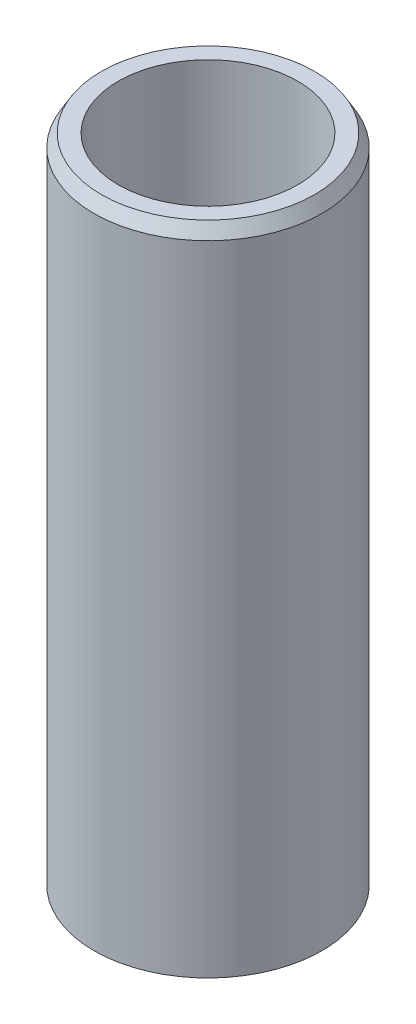
ISO-10303-21;
HEADER;
FILE_DESCRIPTION(('STEP AP214'),'2;1');
FILE_NAME('part.step','',(''),(''),'','','');
FILE_SCHEMA(('AUTOMOTIVE_DESIGN { 1 0 10303 214 1 1 1 1 }'));
ENDSEC;
DATA;
#1=APPLICATION_CONTEXT('core data for automotive mechanical design processes');
#2=APPLICATION_PROTOCOL_DEFINITION('international standard','automotive_design',2000,#1);
#3=PRODUCT_CONTEXT('',#1,'mechanical');
#4=PRODUCT('Part','Part','',(#3));
#5=PRODUCT_RELATED_PRODUCT_CATEGORY('part','',(#4));
#6=PRODUCT_DEFINITION_FORMATION('','',#4);
#7=PRODUCT_DEFINITION_CONTEXT('part definition',#1,'design');
#8=PRODUCT_DEFINITION('design','',#6,#7);
#9=PRODUCT_DEFINITION_SHAPE('','',#8);
#10=(LENGTH_UNIT() NAMED_UNIT(*) SI_UNIT(.MILLI.,.METRE.));
#11=(NAMED_UNIT(*) PLANE_ANGLE_UNIT() SI_UNIT($,.RADIAN.));
#12=(NAMED_UNIT(*) SI_UNIT($,.STERADIAN.) SOLID_ANGLE_UNIT());
#13=UNCERTAINTY_MEASURE_WITH_UNIT(LENGTH_MEASURE(1.E-05),#10,'distance_accuracy_value','');
#14=(GEOMETRIC_REPRESENTATION_CONTEXT(3) GLOBAL_UNCERTAINTY_ASSIGNED_CONTEXT((#13)) GLOBAL_UNIT_ASSIGNED_CONTEXT((#10,
#11,#12)) REPRESENTATION_CONTEXT('',''));
#15=CARTESIAN_POINT('',(0.,0.,0.));
#16=DIRECTION('',(0.,0.,1.));
#17=DIRECTION('',(1.,0.,0.));
#18=AXIS2_PLACEMENT_3D('',#15,#16,#17);
#19=CARTESIAN_POINT('',(0.,288.745215291546,0.));
#20=DIRECTION('',(0.,-1.,0.));
#21=DIRECTION('',(0.,0.,-1.));
#22=AXIS2_PLACEMENT_3D('',#19,#20,#21);
#23=CYLINDRICAL_SURFACE('',#22,50.);
#24=CARTESIAN_POINT('',(0.,283.167460944101,0.));
#25=DIRECTION('',(0.,1.,0.));
#26=DIRECTION('',(0.,0.,1.));
#27=AXIS2_PLACEMENT_3D('',#24,#25,#26);
#28=CIRCLE('',#27,50.);
#29=CARTESIAN_POINT('',(0.,283.167460944101,50.));
#30=VERTEX_POINT('',#29);
#31=EDGE_CURVE('E50',#30,#30,#28,.F.);
#32=ORIENTED_EDGE('',*,*,#31,.T.);
#33=EDGE_LOOP('',(#32));
#34=FACE_BOUND('',#33,.T.);
#35=CARTESIAN_POINT('',(0.,3.22031797397099,0.));
#36=DIRECTION('',(0.,1.,0.));
#37=DIRECTION('',(0.,0.,1.));
#38=AXIS2_PLACEMENT_3D('',#35,#36,#37);
#39=CIRCLE('',#38,50.);
#40=CARTESIAN_POINT('',(0.,3.22031797397099,50.));
#41=VERTEX_POINT('',#40);
#42=EDGE_CURVE('E51',#41,#41,#39,.T.);
#43=ORIENTED_EDGE('',*,*,#42,.T.);
#44=EDGE_LOOP('',(#43));
#45=FACE_BOUND('',#44,.T.);
#46=ADVANCED_FACE('F39',(#34,#45),#23,.T.);
#47=CARTESIAN_POINT('',(0.,288.745215291546,0.));
#48=DIRECTION('',(0.,1.,0.));
#49=DIRECTION('',(0.,0.,1.));
#50=AXIS2_PLACEMENT_3D('',#47,#48,#49);
#51=PLANE('',#50);
#52=CARTESIAN_POINT('',(0.,288.745215291546,0.));
#53=DIRECTION('',(0.,1.,0.));
#54=DIRECTION('',(0.,0.,1.));
#55=AXIS2_PLACEMENT_3D('',#52,#53,#54);
#56=CIRCLE('',#55,46.7796820260291);
#57=CARTESIAN_POINT('',(0.,288.745215291546,46.7796820260291));
#58=VERTEX_POINT('',#57);
#59=EDGE_CURVE('E54',#58,#58,#56,.T.);
#60=ORIENTED_EDGE('',*,*,#59,.T.);
#61=EDGE_LOOP('',(#60));
#62=FACE_BOUND('',#61,.T.);
#63=CARTESIAN_POINT('',(0.,288.745215291546,0.));
#64=DIRECTION('',(0.,1.,0.));
#65=DIRECTION('',(0.,0.,1.));
#66=AXIS2_PLACEMENT_3D('',#63,#64,#65);
#67=CIRCLE('',#66,39.3678445322698);
#68=CARTESIAN_POINT('',(0.,288.745215291546,39.3678445322698));
#69=VERTEX_POINT('',#68);
#70=EDGE_CURVE('E58',#69,#69,#67,.T.);
#71=ORIENTED_EDGE('',*,*,#70,.F.);
#72=EDGE_LOOP('',(#71));
#73=FACE_BOUND('',#72,.T.);
#74=ADVANCED_FACE('F69',(#62,#73),#51,.T.);
#75=CARTESIAN_POINT('',(0.,0.,0.));
#76=DIRECTION('',(0.,1.,0.));
#77=DIRECTION('',(0.,0.,1.));
#78=AXIS2_PLACEMENT_3D('',#75,#76,#77);
#79=PLANE('',#78);
#80=CARTESIAN_POINT('',(0.,0.,0.));
#81=DIRECTION('',(0.,1.,0.));
#82=DIRECTION('',(0.,0.,1.));
#83=AXIS2_PLACEMENT_3D('',#80,#81,#82);
#84=CIRCLE('',#83,44.4222456525549);
#85=CARTESIAN_POINT('',(0.,0.,44.4222456525549));
#86=VERTEX_POINT('',#85);
#87=EDGE_CURVE('E10',#86,#86,#84,.F.);
#88=ORIENTED_EDGE('',*,*,#87,.T.);
#89=EDGE_LOOP('',(#88));
#90=FACE_BOUND('',#89,.T.);
#91=CARTESIAN_POINT('',(0.,0.,0.));
#92=DIRECTION('',(0.,1.,0.));
#93=DIRECTION('',(0.,0.,1.));
#94=AXIS2_PLACEMENT_3D('',#91,#92,#93);
#95=CIRCLE('',#94,39.3678445322698);
#96=CARTESIAN_POINT('',(0.,0.,39.3678445322698));
#97=VERTEX_POINT('',#96);
#98=EDGE_CURVE('E63',#97,#97,#95,.T.);
#99=ORIENTED_EDGE('',*,*,#98,.T.);
#100=EDGE_LOOP('',(#99));
#101=FACE_BOUND('',#100,.T.);
#102=ADVANCED_FACE('F75',(#90,#101),#79,.F.);
#103=CARTESIAN_POINT('',(0.,288.745215291546,0.));
#104=DIRECTION('',(0.,-1.,0.));
#105=DIRECTION('',(0.,0.,-1.));
#106=AXIS2_PLACEMENT_3D('',#103,#104,#105);
#107=CYLINDRICAL_SURFACE('',#106,39.3678445322698);
#108=ORIENTED_EDGE('',*,*,#70,.T.);
#109=EDGE_LOOP('',(#108));
#110=FACE_BOUND('',#109,.T.);
#111=ORIENTED_EDGE('',*,*,#98,.F.);
#112=EDGE_LOOP('',(#111));
#113=FACE_BOUND('',#112,.T.);
#114=ADVANCED_FACE('F70',(#110,#113),#107,.F.);
#115=CARTESIAN_POINT('',(0.,288.745215291546,0.));
#116=DIRECTION('',(0.,-1.,0.));
#117=DIRECTION('',(0.,0.,-1.));
#118=AXIS2_PLACEMENT_3D('',#115,#116,#117);
#119=CONICAL_SURFACE('',#118,46.7796820260291,0.523598775598295);
#120=ORIENTED_EDGE('',*,*,#31,.F.);
#121=EDGE_LOOP('',(#120));
#122=FACE_BOUND('',#121,.T.);
#123=ORIENTED_EDGE('',*,*,#59,.F.);
#124=EDGE_LOOP('',(#123));
#125=FACE_BOUND('',#124,.T.);
#126=ADVANCED_FACE('F81',(#122,#125),#119,.T.);
#127=CARTESIAN_POINT('',(0.,3.22031797397099,0.));
#128=DIRECTION('',(0.,1.,0.));
#129=DIRECTION('',(0.,0.,1.));
#130=AXIS2_PLACEMENT_3D('',#127,#128,#129);
#131=CONICAL_SURFACE('',#130,50.,1.0471975511966);
#132=ORIENTED_EDGE('',*,*,#87,.F.);
#133=EDGE_LOOP('',(#132));
#134=FACE_BOUND('',#133,.T.);
#135=ORIENTED_EDGE('',*,*,#42,.F.);
#136=EDGE_LOOP('',(#135));
#137=FACE_BOUND('',#136,.T.);
#138=ADVANCED_FACE('F45',(#134,#137),#131,.T.);
#139=CLOSED_SHELL('',(#46,#74,#102,#114,#126,#138));
#140=MANIFOLD_SOLID_BREP('B2',#139);
#141=ADVANCED_BREP_SHAPE_REPRESENTATION('',(#18,#140),#14);
#142=SHAPE_DEFINITION_REPRESENTATION(#9,#141);
ENDSEC;
END-ISO-10303-21;
